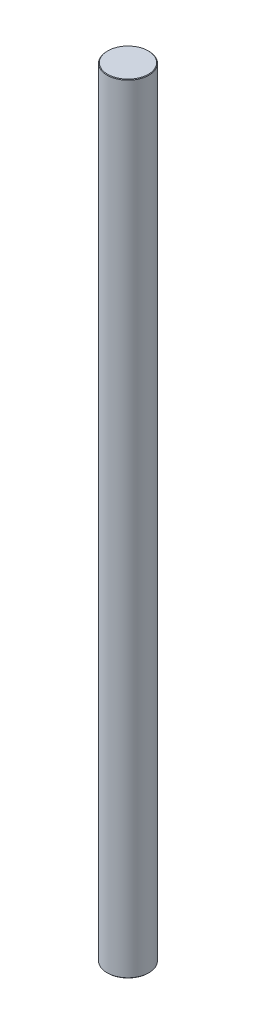
ISO-10303-21;
HEADER;
FILE_DESCRIPTION(('STEP AP214'),'2;1');
FILE_NAME('part.step','',(''),(''),'','','');
FILE_SCHEMA(('AUTOMOTIVE_DESIGN { 1 0 10303 214 1 1 1 1 }'));
ENDSEC;
DATA;
#1=APPLICATION_CONTEXT('core data for automotive mechanical design processes');
#2=APPLICATION_PROTOCOL_DEFINITION('international standard','automotive_design',2000,#1);
#3=PRODUCT_CONTEXT('',#1,'mechanical');
#4=PRODUCT('Part','Part','',(#3));
#5=PRODUCT_RELATED_PRODUCT_CATEGORY('part','',(#4));
#6=PRODUCT_DEFINITION_FORMATION('','',#4);
#7=PRODUCT_DEFINITION_CONTEXT('part definition',#1,'design');
#8=PRODUCT_DEFINITION('design','',#6,#7);
#9=PRODUCT_DEFINITION_SHAPE('','',#8);
#10=(LENGTH_UNIT() NAMED_UNIT(*) SI_UNIT(.MILLI.,.METRE.));
#11=(NAMED_UNIT(*) PLANE_ANGLE_UNIT() SI_UNIT($,.RADIAN.));
#12=(NAMED_UNIT(*) SI_UNIT($,.STERADIAN.) SOLID_ANGLE_UNIT());
#13=UNCERTAINTY_MEASURE_WITH_UNIT(LENGTH_MEASURE(1.E-05),#10,'distance_accuracy_value','');
#14=(GEOMETRIC_REPRESENTATION_CONTEXT(3) GLOBAL_UNCERTAINTY_ASSIGNED_CONTEXT((#13)) GLOBAL_UNIT_ASSIGNED_CONTEXT((#10,
#11,#12)) REPRESENTATION_CONTEXT('',''));
#15=CARTESIAN_POINT('',(0.,0.,0.));
#16=DIRECTION('',(0.,0.,1.));
#17=DIRECTION('',(1.,0.,0.));
#18=AXIS2_PLACEMENT_3D('',#15,#16,#17);
#19=CARTESIAN_POINT('',(0.,177.8,0.));
#20=DIRECTION('',(0.,-1.,0.));
#21=DIRECTION('',(0.,0.,-1.));
#22=AXIS2_PLACEMENT_3D('',#19,#20,#21);
#23=CYLINDRICAL_SURFACE('',#22,4.7625);
#24=CARTESIAN_POINT('',(0.,0.126999999999988,0.));
#25=DIRECTION('',(0.,1.,0.));
#26=DIRECTION('',(0.,0.,1.));
#27=AXIS2_PLACEMENT_3D('',#24,#25,#26);
#28=CIRCLE('',#27,4.7625);
#29=CARTESIAN_POINT('',(0.,0.126999999999988,4.7625));
#30=VERTEX_POINT('',#29);
#31=EDGE_CURVE('E55',#30,#30,#28,.T.);
#32=ORIENTED_EDGE('',*,*,#31,.T.);
#33=EDGE_LOOP('',(#32));
#34=FACE_BOUND('',#33,.T.);
#35=CARTESIAN_POINT('',(0.,177.673,0.));
#36=DIRECTION('',(0.,1.,0.));
#37=DIRECTION('',(0.,0.,1.));
#38=AXIS2_PLACEMENT_3D('',#35,#36,#37);
#39=CIRCLE('',#38,4.7625);
#40=CARTESIAN_POINT('',(0.,177.673,4.7625));
#41=VERTEX_POINT('',#40);
#42=EDGE_CURVE('E61',#41,#41,#39,.F.);
#43=ORIENTED_EDGE('',*,*,#42,.T.);
#44=EDGE_LOOP('',(#43));
#45=FACE_BOUND('',#44,.T.);
#46=ADVANCED_FACE('F40',(#34,#45),#23,.T.);
#47=CARTESIAN_POINT('',(0.,177.8,0.));
#48=DIRECTION('',(0.,1.,0.));
#49=DIRECTION('',(0.,0.,1.));
#50=AXIS2_PLACEMENT_3D('',#47,#48,#49);
#51=PLANE('',#50);
#52=CARTESIAN_POINT('',(0.,177.8,0.));
#53=DIRECTION('',(0.,1.,0.));
#54=DIRECTION('',(0.,0.,1.));
#55=AXIS2_PLACEMENT_3D('',#52,#53,#54);
#56=CIRCLE('',#55,4.63549999999999);
#57=CARTESIAN_POINT('',(0.,177.8,4.63549999999999));
#58=VERTEX_POINT('',#57);
#59=EDGE_CURVE('E10',#58,#58,#56,.T.);
#60=ORIENTED_EDGE('',*,*,#59,.T.);
#61=EDGE_LOOP('',(#60));
#62=FACE_BOUND('',#61,.T.);
#63=ADVANCED_FACE('F78',(#62),#51,.T.);
#64=CARTESIAN_POINT('',(0.,0.,0.));
#65=DIRECTION('',(0.,1.,0.));
#66=DIRECTION('',(0.,0.,1.));
#67=AXIS2_PLACEMENT_3D('',#64,#65,#66);
#68=PLANE('',#67);
#69=CARTESIAN_POINT('',(0.,0.,0.));
#70=DIRECTION('',(0.,1.,0.));
#71=DIRECTION('',(0.,0.,1.));
#72=AXIS2_PLACEMENT_3D('',#69,#70,#71);
#73=CIRCLE('',#72,4.63550000000001);
#74=CARTESIAN_POINT('',(0.,0.,4.63550000000001));
#75=VERTEX_POINT('',#74);
#76=EDGE_CURVE('E48',#75,#75,#73,.F.);
#77=ORIENTED_EDGE('',*,*,#76,.T.);
#78=EDGE_LOOP('',(#77));
#79=FACE_BOUND('',#78,.T.);
#80=ADVANCED_FACE('F75',(#79),#68,.F.);
#81=CARTESIAN_POINT('',(0.,0.126999999999988,0.));
#82=DIRECTION('',(0.,1.,0.));
#83=DIRECTION('',(0.,0.,1.));
#84=AXIS2_PLACEMENT_3D('',#81,#82,#83);
#85=CONICAL_SURFACE('',#84,4.7625,0.785398163397438);
#86=ORIENTED_EDGE('',*,*,#76,.F.);
#87=EDGE_LOOP('',(#86));
#88=FACE_BOUND('',#87,.T.);
#89=ORIENTED_EDGE('',*,*,#31,.F.);
#90=EDGE_LOOP('',(#89));
#91=FACE_BOUND('',#90,.T.);
#92=ADVANCED_FACE('F71',(#88,#91),#85,.T.);
#93=CARTESIAN_POINT('',(0.,177.8,0.));
#94=DIRECTION('',(0.,-1.,0.));
#95=DIRECTION('',(0.,0.,-1.));
#96=AXIS2_PLACEMENT_3D('',#93,#94,#95);
#97=CONICAL_SURFACE('',#96,4.63549999999999,0.785398163397438);
#98=ORIENTED_EDGE('',*,*,#42,.F.);
#99=EDGE_LOOP('',(#98));
#100=FACE_BOUND('',#99,.T.);
#101=ORIENTED_EDGE('',*,*,#59,.F.);
#102=EDGE_LOOP('',(#101));
#103=FACE_BOUND('',#102,.T.);
#104=ADVANCED_FACE('F42',(#100,#103),#97,.T.);
#105=CLOSED_SHELL('',(#46,#63,#80,#92,#104));
#106=MANIFOLD_SOLID_BREP('B2',#105);
#107=ADVANCED_BREP_SHAPE_REPRESENTATION('',(#18,#106),#14);
#108=SHAPE_DEFINITION_REPRESENTATION(#9,#107);
ENDSEC;
END-ISO-10303-21;
